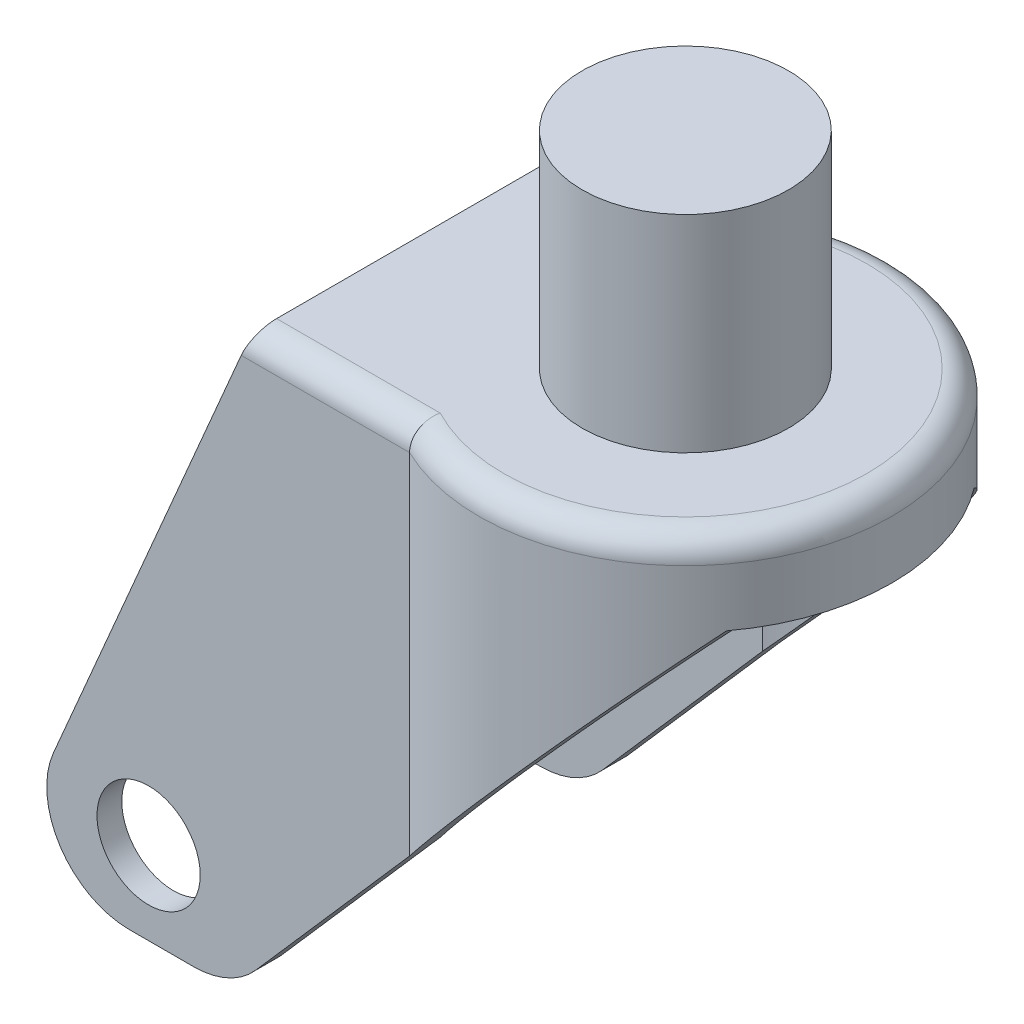
ISO-10303-21;
HEADER;
FILE_DESCRIPTION(('STEP AP214'),'2;1');
FILE_NAME('part.step','',(''),(''),'','','');
FILE_SCHEMA(('AUTOMOTIVE_DESIGN { 1 0 10303 214 1 1 1 1 }'));
ENDSEC;
DATA;
#1=APPLICATION_CONTEXT('core data for automotive mechanical design processes');
#2=APPLICATION_PROTOCOL_DEFINITION('international standard','automotive_design',2000,#1);
#3=PRODUCT_CONTEXT('',#1,'mechanical');
#4=PRODUCT('Part','Part','',(#3));
#5=PRODUCT_RELATED_PRODUCT_CATEGORY('part','',(#4));
#6=PRODUCT_DEFINITION_FORMATION('','',#4);
#7=PRODUCT_DEFINITION_CONTEXT('part definition',#1,'design');
#8=PRODUCT_DEFINITION('design','',#6,#7);
#9=PRODUCT_DEFINITION_SHAPE('','',#8);
#10=(LENGTH_UNIT() NAMED_UNIT(*) SI_UNIT(.MILLI.,.METRE.));
#11=(NAMED_UNIT(*) PLANE_ANGLE_UNIT() SI_UNIT($,.RADIAN.));
#12=(NAMED_UNIT(*) SI_UNIT($,.STERADIAN.) SOLID_ANGLE_UNIT());
#13=UNCERTAINTY_MEASURE_WITH_UNIT(LENGTH_MEASURE(1.E-05),#10,'distance_accuracy_value','');
#14=(GEOMETRIC_REPRESENTATION_CONTEXT(3) GLOBAL_UNCERTAINTY_ASSIGNED_CONTEXT((#13)) GLOBAL_UNIT_ASSIGNED_CONTEXT((#10,
#11,#12)) REPRESENTATION_CONTEXT('',''));
#15=CARTESIAN_POINT('',(0.,0.,0.));
#16=DIRECTION('',(0.,0.,1.));
#17=DIRECTION('',(1.,0.,0.));
#18=AXIS2_PLACEMENT_3D('',#15,#16,#17);
#19=CARTESIAN_POINT('',(0.,-60.,0.));
#20=DIRECTION('',(0.,1.,0.));
#21=DIRECTION('',(0.,0.,1.));
#22=AXIS2_PLACEMENT_3D('',#19,#20,#21);
#23=CYLINDRICAL_SURFACE('',#22,22.);
#24=CARTESIAN_POINT('',(0.,-3.,0.));
#25=DIRECTION('',(0.,1.,0.));
#26=DIRECTION('',(0.,0.,1.));
#27=AXIS2_PLACEMENT_3D('',#24,#25,#26);
#28=CIRCLE('',#27,22.);
#29=CARTESIAN_POINT('',(-10.1857743937317,-3.,-19.5));
#30=VERTEX_POINT('',#29);
#31=CARTESIAN_POINT('',(-10.1857743937317,-3.,19.5));
#32=VERTEX_POINT('',#31);
#33=EDGE_CURVE('E205',#30,#32,#28,.F.);
#34=ORIENTED_EDGE('',*,*,#33,.F.);
#35=DIRECTION('',(0.,1.,0.));
#36=VECTOR('',#35,1.);
#37=CARTESIAN_POINT('',(-10.1857743937317,-60.,-19.5));
#38=LINE('',#37,#36);
#39=CARTESIAN_POINT('',(-10.1857743937317,-44.4980278785505,-19.5));
#40=VERTEX_POINT('',#39);
#41=EDGE_CURVE('E210',#30,#40,#38,.F.);
#42=ORIENTED_EDGE('',*,*,#41,.T.);
#43=CARTESIAN_POINT('',(0.,-32.8571428571429,0.));
#44=DIRECTION('',(-0.752576694706878,0.658504607868518,0.));
#45=DIRECTION('',(0.658504607868518,0.752576694706878,0.));
#46=AXIS2_PLACEMENT_3D('',#43,#44,#45);
#47=ELLIPSE('',#46,33.409029697166,22.);
#48=CARTESIAN_POINT('',(20.,-10.,-9.16515138991168));
#49=VERTEX_POINT('',#48);
#50=EDGE_CURVE('E258',#40,#49,#47,.F.);
#51=ORIENTED_EDGE('',*,*,#50,.T.);
#52=CARTESIAN_POINT('',(0.,-10.,0.));
#53=DIRECTION('',(0.,1.,0.));
#54=DIRECTION('',(0.,0.,1.));
#55=AXIS2_PLACEMENT_3D('',#52,#53,#54);
#56=CIRCLE('',#55,22.);
#57=CARTESIAN_POINT('',(20.,-10.,9.16515138991167));
#58=VERTEX_POINT('',#57);
#59=EDGE_CURVE('E273',#49,#58,#56,.F.);
#60=ORIENTED_EDGE('',*,*,#59,.T.);
#61=CARTESIAN_POINT('',(-10.1857743937317,-44.4980278785505,19.5));
#62=VERTEX_POINT('',#61);
#63=EDGE_CURVE('E208',#58,#62,#47,.F.);
#64=ORIENTED_EDGE('',*,*,#63,.T.);
#65=DIRECTION('',(0.,1.,0.));
#66=VECTOR('',#65,1.);
#67=CARTESIAN_POINT('',(-10.1857743937317,-60.,19.5));
#68=LINE('',#67,#66);
#69=EDGE_CURVE('E192',#62,#32,#68,.T.);
#70=ORIENTED_EDGE('',*,*,#69,.T.);
#71=EDGE_LOOP('',(#34,#42,#51,#60,#64,#70));
#72=FACE_BOUND('',#71,.T.);
#73=ADVANCED_FACE('F62',(#72),#23,.F.);
#74=CARTESIAN_POINT('',(-60.,-70.,-22.5));
#75=DIRECTION('',(0.,-1.,0.));
#76=DIRECTION('',(0.,0.,-1.));
#77=AXIS2_PLACEMENT_3D('',#74,#75,#76);
#78=PLANE('',#77);
#79=DIRECTION('',(1.,0.,0.));
#80=VECTOR('',#79,1.);
#81=CARTESIAN_POINT('',(-64.875,-70.,19.5));
#82=LINE('',#81,#80);
#83=CARTESIAN_POINT('',(-44.8346098487659,-70.,19.5));
#84=VERTEX_POINT('',#83);
#85=CARTESIAN_POINT('',(-37.0376822659183,-70.,19.5));
#86=VERTEX_POINT('',#85);
#87=EDGE_CURVE('E218',#84,#86,#82,.T.);
#88=ORIENTED_EDGE('',*,*,#87,.T.);
#89=DIRECTION('',(0.,0.,-1.));
#90=VECTOR('',#89,1.);
#91=CARTESIAN_POINT('',(-37.0376822659183,-70.,22.5));
#92=LINE('',#91,#90);
#93=CARTESIAN_POINT('',(-37.0376822659183,-70.,22.5));
#94=VERTEX_POINT('',#93);
#95=EDGE_CURVE('E84',#86,#94,#92,.F.);
#96=ORIENTED_EDGE('',*,*,#95,.T.);
#97=DIRECTION('',(1.,0.,0.));
#98=VECTOR('',#97,1.);
#99=CARTESIAN_POINT('',(-60.,-70.,22.5));
#100=LINE('',#99,#98);
#101=CARTESIAN_POINT('',(-44.8346098487659,-70.,22.5));
#102=VERTEX_POINT('',#101);
#103=EDGE_CURVE('E199',#102,#94,#100,.T.);
#104=ORIENTED_EDGE('',*,*,#103,.F.);
#105=DIRECTION('',(0.,0.,-1.));
#106=VECTOR('',#105,1.);
#107=CARTESIAN_POINT('',(-44.8346098487659,-70.,19.5));
#108=LINE('',#107,#106);
#109=EDGE_CURVE('E420',#102,#84,#108,.T.);
#110=ORIENTED_EDGE('',*,*,#109,.T.);
#111=EDGE_LOOP('',(#88,#96,#104,#110));
#112=FACE_BOUND('',#111,.T.);
#113=ADVANCED_FACE('F338',(#112),#78,.T.);
#114=CARTESIAN_POINT('',(20.,-10.,-25.));
#115=DIRECTION('',(-0.752576694706878,0.658504607868518,0.));
#116=DIRECTION('',(-0.658504607868518,-0.752576694706878,0.));
#117=AXIS2_PLACEMENT_3D('',#114,#115,#116);
#118=PLANE('',#117);
#119=DIRECTION('',(-0.658504607868518,-0.752576694706878,0.));
#120=VECTOR('',#119,1.);
#121=CARTESIAN_POINT('',(-9.73451327433627,-43.9823008849558,22.5));
#122=LINE('',#121,#120);
#123=CARTESIAN_POINT('',(-10.8972473588517,-45.3111398386877,22.5));
#124=VERTEX_POINT('',#123);
#125=CARTESIAN_POINT('',(-29.5119153188495,-66.5850460786852,22.5));
#126=VERTEX_POINT('',#125);
#127=EDGE_CURVE('E252',#124,#126,#122,.T.);
#128=ORIENTED_EDGE('',*,*,#127,.T.);
#129=DIRECTION('',(0.,0.,-1.));
#130=VECTOR('',#129,1.);
#131=CARTESIAN_POINT('',(-29.5119153188495,-66.5850460786852,19.5));
#132=LINE('',#131,#130);
#133=CARTESIAN_POINT('',(-29.5119153188495,-66.5850460786852,19.5));
#134=VERTEX_POINT('',#133);
#135=EDGE_CURVE('E414',#126,#134,#132,.T.);
#136=ORIENTED_EDGE('',*,*,#135,.T.);
#137=DIRECTION('',(-0.658504607868518,-0.752576694706878,0.));
#138=VECTOR('',#137,1.);
#139=CARTESIAN_POINT('',(-9.73451327433627,-43.9823008849557,19.5));
#140=LINE('',#139,#138);
#141=EDGE_CURVE('E248',#62,#134,#140,.T.);
#142=ORIENTED_EDGE('',*,*,#141,.F.);
#143=ORIENTED_EDGE('',*,*,#63,.F.);
#144=DIRECTION('',(0.,0.,1.));
#145=VECTOR('',#144,1.);
#146=CARTESIAN_POINT('',(20.,-10.,-25.));
#147=LINE('',#146,#145);
#148=CARTESIAN_POINT('',(20.,-10.,15.));
#149=VERTEX_POINT('',#148);
#150=EDGE_CURVE('E209',#58,#149,#147,.T.);
#151=ORIENTED_EDGE('',*,*,#150,.T.);
#152=CARTESIAN_POINT('',(0.,-32.8571428571429,0.));
#153=DIRECTION('',(-0.752576694706878,0.658504607868518,0.));
#154=DIRECTION('',(0.658504607868518,0.752576694706878,0.));
#155=AXIS2_PLACEMENT_3D('',#152,#153,#154);
#156=ELLIPSE('',#155,37.9648064740523,25.);
#157=EDGE_CURVE('E255',#149,#124,#156,.F.);
#158=ORIENTED_EDGE('',*,*,#157,.T.);
#159=EDGE_LOOP('',(#128,#136,#142,#143,#151,#158));
#160=FACE_BOUND('',#159,.T.);
#161=ADVANCED_FACE('F343',(#160),#118,.F.);
#162=CARTESIAN_POINT('',(0.,-60.,0.));
#163=DIRECTION('',(0.,1.,0.));
#164=DIRECTION('',(0.,0.,1.));
#165=AXIS2_PLACEMENT_3D('',#162,#163,#164);
#166=CYLINDRICAL_SURFACE('',#165,25.);
#167=DIRECTION('',(0.,1.,0.));
#168=VECTOR('',#167,1.);
#169=CARTESIAN_POINT('',(-10.8972473588517,-60.,-22.5));
#170=LINE('',#169,#168);
#171=CARTESIAN_POINT('',(-10.8972473588517,-3.,-22.5));
#172=VERTEX_POINT('',#171);
#173=CARTESIAN_POINT('',(-10.8972473588517,-45.3111398386877,-22.5));
#174=VERTEX_POINT('',#173);
#175=EDGE_CURVE('E266',#172,#174,#170,.F.);
#176=ORIENTED_EDGE('',*,*,#175,.F.);
#177=CARTESIAN_POINT('',(0.,-3.,0.));
#178=DIRECTION('',(0.,1.,0.));
#179=DIRECTION('',(0.,0.,1.));
#180=AXIS2_PLACEMENT_3D('',#177,#178,#179);
#181=CIRCLE('',#180,25.);
#182=CARTESIAN_POINT('',(-10.8972473588517,-3.,22.5));
#183=VERTEX_POINT('',#182);
#184=EDGE_CURVE('E288',#172,#183,#181,.F.);
#185=ORIENTED_EDGE('',*,*,#184,.T.);
#186=DIRECTION('',(0.,1.,0.));
#187=VECTOR('',#186,1.);
#188=CARTESIAN_POINT('',(-10.8972473588517,-60.,22.5));
#189=LINE('',#188,#187);
#190=EDGE_CURVE('E270',#124,#183,#189,.T.);
#191=ORIENTED_EDGE('',*,*,#190,.F.);
#192=ORIENTED_EDGE('',*,*,#157,.F.);
#193=CARTESIAN_POINT('',(0.,-10.,0.));
#194=DIRECTION('',(0.,1.,0.));
#195=DIRECTION('',(0.,0.,1.));
#196=AXIS2_PLACEMENT_3D('',#193,#194,#195);
#197=CIRCLE('',#196,25.);
#198=CARTESIAN_POINT('',(20.,-10.,-15.));
#199=VERTEX_POINT('',#198);
#200=EDGE_CURVE('E260',#199,#149,#197,.F.);
#201=ORIENTED_EDGE('',*,*,#200,.F.);
#202=EDGE_CURVE('E256',#174,#199,#156,.F.);
#203=ORIENTED_EDGE('',*,*,#202,.F.);
#204=EDGE_LOOP('',(#176,#185,#191,#192,#201,#203));
#205=FACE_BOUND('',#204,.T.);
#206=ADVANCED_FACE('F351',(#205),#166,.T.);
#207=CARTESIAN_POINT('',(0.,0.,0.));
#208=DIRECTION('',(0.,1.,0.));
#209=DIRECTION('',(0.,0.,1.));
#210=AXIS2_PLACEMENT_3D('',#207,#208,#209);
#211=PLANE('',#210);
#212=CARTESIAN_POINT('',(0.,0.,0.));
#213=DIRECTION('',(0.,1.,0.));
#214=DIRECTION('',(0.,0.,1.));
#215=AXIS2_PLACEMENT_3D('',#212,#213,#214);
#216=CIRCLE('',#215,12.5);
#217=CARTESIAN_POINT('',(0.,0.,12.5));
#218=VERTEX_POINT('',#217);
#219=EDGE_CURVE('E476',#218,#218,#216,.T.);
#220=ORIENTED_EDGE('',*,*,#219,.F.);
#221=EDGE_LOOP('',(#220));
#222=FACE_BOUND('',#221,.T.);
#223=CARTESIAN_POINT('',(0.,0.,0.));
#224=DIRECTION('',(0.,1.,0.));
#225=DIRECTION('',(0.,0.,1.));
#226=AXIS2_PLACEMENT_3D('',#223,#224,#225);
#227=CIRCLE('',#226,22.);
#228=CARTESIAN_POINT('',(-10.1857743937317,0.,19.5));
#229=VERTEX_POINT('',#228);
#230=CARTESIAN_POINT('',(-10.1857743937317,0.,-19.5));
#231=VERTEX_POINT('',#230);
#232=EDGE_CURVE('E280',#229,#231,#227,.T.);
#233=ORIENTED_EDGE('',*,*,#232,.T.);
#234=DIRECTION('',(1.,0.,0.));
#235=VECTOR('',#234,1.);
#236=CARTESIAN_POINT('',(0.,0.,-19.5));
#237=LINE('',#236,#235);
#238=CARTESIAN_POINT('',(-30.,0.,-19.5));
#239=VERTEX_POINT('',#238);
#240=EDGE_CURVE('E282',#231,#239,#237,.F.);
#241=ORIENTED_EDGE('',*,*,#240,.T.);
#242=DIRECTION('',(0.,0.,1.));
#243=VECTOR('',#242,1.);
#244=CARTESIAN_POINT('',(-30.,0.,-25.));
#245=LINE('',#244,#243);
#246=CARTESIAN_POINT('',(-30.,0.,19.5));
#247=VERTEX_POINT('',#246);
#248=EDGE_CURVE('E228',#239,#247,#245,.T.);
#249=ORIENTED_EDGE('',*,*,#248,.T.);
#250=DIRECTION('',(1.,0.,0.));
#251=VECTOR('',#250,1.);
#252=CARTESIAN_POINT('',(0.,0.,19.5));
#253=LINE('',#252,#251);
#254=EDGE_CURVE('E278',#247,#229,#253,.T.);
#255=ORIENTED_EDGE('',*,*,#254,.T.);
#256=EDGE_LOOP('',(#233,#241,#249,#255));
#257=FACE_BOUND('',#256,.T.);
#258=ADVANCED_FACE('F349',(#222,#257),#211,.T.);
#259=CARTESIAN_POINT('',(-60.,0.,22.5));
#260=DIRECTION('',(0.,0.,1.));
#261=DIRECTION('',(0.,-1.,0.));
#262=AXIS2_PLACEMENT_3D('',#259,#260,#261);
#263=PLANE('',#262);
#264=CARTESIAN_POINT('',(-42.5,-60.,22.5));
#265=DIRECTION('',(0.,0.,1.));
#266=DIRECTION('',(1.,0.,0.));
#267=AXIS2_PLACEMENT_3D('',#264,#265,#266);
#268=CIRCLE('',#267,6.25000000000001);
#269=CARTESIAN_POINT('',(-36.25,-60.,22.5));
#270=VERTEX_POINT('',#269);
#271=EDGE_CURVE('E475',#270,#270,#268,.T.);
#272=ORIENTED_EDGE('',*,*,#271,.F.);
#273=EDGE_LOOP('',(#272));
#274=FACE_BOUND('',#273,.T.);
#275=ORIENTED_EDGE('',*,*,#103,.T.);
#276=CARTESIAN_POINT('',(-37.0376822659183,-60.,22.5));
#277=DIRECTION('',(0.,0.,1.));
#278=DIRECTION('',(0.,-1.,0.));
#279=AXIS2_PLACEMENT_3D('',#276,#277,#278);
#280=CIRCLE('',#279,10.);
#281=EDGE_CURVE('E426',#94,#126,#280,.T.);
#282=ORIENTED_EDGE('',*,*,#281,.T.);
#283=ORIENTED_EDGE('',*,*,#127,.F.);
#284=ORIENTED_EDGE('',*,*,#190,.T.);
#285=DIRECTION('',(1.,0.,0.));
#286=VECTOR('',#285,1.);
#287=CARTESIAN_POINT('',(-60.,-3.,22.5));
#288=LINE('',#287,#286);
#289=CARTESIAN_POINT('',(-31.2857142857143,-3.,22.5));
#290=VERTEX_POINT('',#289);
#291=EDGE_CURVE('E290',#183,#290,#288,.F.);
#292=ORIENTED_EDGE('',*,*,#291,.T.);
#293=DIRECTION('',(0.393919298579168,0.919145030018058,0.));
#294=VECTOR('',#293,1.);
#295=CARTESIAN_POINT('',(-34.6551724137931,-10.8620689655173,22.5));
#296=LINE('',#295,#294);
#297=CARTESIAN_POINT('',(-54.0260601489464,-56.0608070142083,22.5));
#298=VERTEX_POINT('',#297);
#299=EDGE_CURVE('E240',#298,#290,#296,.T.);
#300=ORIENTED_EDGE('',*,*,#299,.F.);
#301=CARTESIAN_POINT('',(-44.8346098487659,-60.,22.5));
#302=DIRECTION('',(0.,0.,1.));
#303=DIRECTION('',(0.,-1.,0.));
#304=AXIS2_PLACEMENT_3D('',#301,#302,#303);
#305=CIRCLE('',#304,10.);
#306=EDGE_CURVE('E424',#298,#102,#305,.T.);
#307=ORIENTED_EDGE('',*,*,#306,.T.);
#308=EDGE_LOOP('',(#275,#282,#283,#284,#292,#300,#307));
#309=FACE_BOUND('',#308,.T.);
#310=ADVANCED_FACE('F348',(#274,#309),#263,.T.);
#311=CARTESIAN_POINT('',(-60.,0.,-22.5));
#312=DIRECTION('',(0.,0.,-1.));
#313=DIRECTION('',(0.,1.,0.));
#314=AXIS2_PLACEMENT_3D('',#311,#312,#313);
#315=PLANE('',#314);
#316=CARTESIAN_POINT('',(-42.5,-60.,-22.5));
#317=DIRECTION('',(0.,0.,-1.));
#318=DIRECTION('',(0.,1.,0.));
#319=AXIS2_PLACEMENT_3D('',#316,#317,#318);
#320=CIRCLE('',#319,6.25000000000001);
#321=CARTESIAN_POINT('',(-42.5,-53.75,-22.5));
#322=VERTEX_POINT('',#321);
#323=EDGE_CURVE('E224',#322,#322,#320,.T.);
#324=ORIENTED_EDGE('',*,*,#323,.F.);
#325=EDGE_LOOP('',(#324));
#326=FACE_BOUND('',#325,.T.);
#327=DIRECTION('',(0.658504607868518,0.752576694706878,0.));
#328=VECTOR('',#327,1.);
#329=CARTESIAN_POINT('',(-9.73451327433627,-43.9823008849557,-22.5));
#330=LINE('',#329,#328);
#331=CARTESIAN_POINT('',(-29.5119153188495,-66.5850460786852,-22.5));
#332=VERTEX_POINT('',#331);
#333=EDGE_CURVE('E250',#332,#174,#330,.T.);
#334=ORIENTED_EDGE('',*,*,#333,.F.);
#335=CARTESIAN_POINT('',(-37.0376822659183,-60.,-22.5));
#336=DIRECTION('',(0.,0.,-1.));
#337=DIRECTION('',(0.,1.,0.));
#338=AXIS2_PLACEMENT_3D('',#335,#336,#337);
#339=CIRCLE('',#338,10.);
#340=CARTESIAN_POINT('',(-37.0376822659183,-70.,-22.5));
#341=VERTEX_POINT('',#340);
#342=EDGE_CURVE('E400',#332,#341,#339,.T.);
#343=ORIENTED_EDGE('',*,*,#342,.T.);
#344=DIRECTION('',(1.,0.,0.));
#345=VECTOR('',#344,1.);
#346=CARTESIAN_POINT('',(-60.,-70.,-22.5));
#347=LINE('',#346,#345);
#348=CARTESIAN_POINT('',(-44.8346098487658,-70.,-22.5));
#349=VERTEX_POINT('',#348);
#350=EDGE_CURVE('E263',#349,#341,#347,.T.);
#351=ORIENTED_EDGE('',*,*,#350,.F.);
#352=CARTESIAN_POINT('',(-44.8346098487658,-60.,-22.5));
#353=DIRECTION('',(0.,0.,-1.));
#354=DIRECTION('',(0.,1.,0.));
#355=AXIS2_PLACEMENT_3D('',#352,#353,#354);
#356=CIRCLE('',#355,10.);
#357=CARTESIAN_POINT('',(-54.0260601489464,-56.0608070142083,-22.5));
#358=VERTEX_POINT('',#357);
#359=EDGE_CURVE('E398',#349,#358,#356,.T.);
#360=ORIENTED_EDGE('',*,*,#359,.T.);
#361=DIRECTION('',(-0.393919298579168,-0.919145030018058,0.));
#362=VECTOR('',#361,1.);
#363=CARTESIAN_POINT('',(-34.6551724137931,-10.8620689655172,-22.5));
#364=LINE('',#363,#362);
#365=CARTESIAN_POINT('',(-31.2857142857143,-3.,-22.5));
#366=VERTEX_POINT('',#365);
#367=EDGE_CURVE('E237',#366,#358,#364,.T.);
#368=ORIENTED_EDGE('',*,*,#367,.F.);
#369=DIRECTION('',(1.,0.,0.));
#370=VECTOR('',#369,1.);
#371=CARTESIAN_POINT('',(-60.,-3.,-22.5));
#372=LINE('',#371,#370);
#373=EDGE_CURVE('E275',#366,#172,#372,.T.);
#374=ORIENTED_EDGE('',*,*,#373,.T.);
#375=ORIENTED_EDGE('',*,*,#175,.T.);
#376=EDGE_LOOP('',(#334,#343,#351,#360,#368,#374,#375));
#377=FACE_BOUND('',#376,.T.);
#378=ADVANCED_FACE('F368',(#326,#377),#315,.T.);
#379=ORIENTED_EDGE('',*,*,#350,.T.);
#380=DIRECTION('',(0.,0.,-1.));
#381=VECTOR('',#380,1.);
#382=CARTESIAN_POINT('',(-37.0376822659183,-70.,-19.5));
#383=LINE('',#382,#381);
#384=CARTESIAN_POINT('',(-37.0376822659183,-70.,-19.5));
#385=VERTEX_POINT('',#384);
#386=EDGE_CURVE('E408',#341,#385,#383,.F.);
#387=ORIENTED_EDGE('',*,*,#386,.T.);
#388=DIRECTION('',(-1.,0.,0.));
#389=VECTOR('',#388,1.);
#390=CARTESIAN_POINT('',(-29.875,-70.,-19.5));
#391=LINE('',#390,#389);
#392=CARTESIAN_POINT('',(-44.8346098487658,-70.,-19.5));
#393=VERTEX_POINT('',#392);
#394=EDGE_CURVE('E214',#385,#393,#391,.T.);
#395=ORIENTED_EDGE('',*,*,#394,.T.);
#396=DIRECTION('',(0.,0.,-1.));
#397=VECTOR('',#396,1.);
#398=CARTESIAN_POINT('',(-44.8346098487658,-70.,-22.5));
#399=LINE('',#398,#397);
#400=EDGE_CURVE('E405',#393,#349,#399,.T.);
#401=ORIENTED_EDGE('',*,*,#400,.T.);
#402=EDGE_LOOP('',(#379,#387,#395,#401));
#403=FACE_BOUND('',#402,.T.);
#404=ADVANCED_FACE('F345',(#403),#78,.T.);
#405=CARTESIAN_POINT('',(-60.,0.,19.5));
#406=DIRECTION('',(0.,0.,1.));
#407=DIRECTION('',(0.,-1.,0.));
#408=AXIS2_PLACEMENT_3D('',#405,#406,#407);
#409=PLANE('',#408);
#410=CARTESIAN_POINT('',(-42.5,-60.,19.5));
#411=DIRECTION('',(0.,0.,1.));
#412=DIRECTION('',(0.,-1.,0.));
#413=AXIS2_PLACEMENT_3D('',#410,#411,#412);
#414=CIRCLE('',#413,6.25000000000001);
#415=CARTESIAN_POINT('',(-42.5,-66.25,19.5));
#416=VERTEX_POINT('',#415);
#417=EDGE_CURVE('E482',#416,#416,#414,.T.);
#418=ORIENTED_EDGE('',*,*,#417,.T.);
#419=EDGE_LOOP('',(#418));
#420=FACE_BOUND('',#419,.T.);
#421=ORIENTED_EDGE('',*,*,#141,.T.);
#422=CARTESIAN_POINT('',(-37.0376822659183,-60.,19.5));
#423=DIRECTION('',(0.,0.,1.));
#424=DIRECTION('',(0.,-1.,0.));
#425=AXIS2_PLACEMENT_3D('',#422,#423,#424);
#426=CIRCLE('',#425,10.);
#427=EDGE_CURVE('E418',#134,#86,#426,.F.);
#428=ORIENTED_EDGE('',*,*,#427,.T.);
#429=ORIENTED_EDGE('',*,*,#87,.F.);
#430=CARTESIAN_POINT('',(-44.8346098487659,-60.,19.5));
#431=DIRECTION('',(0.,0.,1.));
#432=DIRECTION('',(0.,-1.,0.));
#433=AXIS2_PLACEMENT_3D('',#430,#431,#432);
#434=CIRCLE('',#433,10.);
#435=CARTESIAN_POINT('',(-54.0260601489464,-56.0608070142083,19.5));
#436=VERTEX_POINT('',#435);
#437=EDGE_CURVE('E416',#84,#436,#434,.F.);
#438=ORIENTED_EDGE('',*,*,#437,.T.);
#439=DIRECTION('',(0.393919298579168,0.919145030018058,0.));
#440=VECTOR('',#439,1.);
#441=CARTESIAN_POINT('',(-34.6551724137931,-10.8620689655172,19.5));
#442=LINE('',#441,#440);
#443=CARTESIAN_POINT('',(-31.2857142857143,-3.00000000000001,19.5));
#444=VERTEX_POINT('',#443);
#445=EDGE_CURVE('E194',#436,#444,#442,.T.);
#446=ORIENTED_EDGE('',*,*,#445,.T.);
#447=DIRECTION('',(1.,0.,0.));
#448=VECTOR('',#447,1.);
#449=CARTESIAN_POINT('',(-60.,-3.00000000000001,19.5));
#450=LINE('',#449,#448);
#451=EDGE_CURVE('E188',#444,#32,#450,.T.);
#452=ORIENTED_EDGE('',*,*,#451,.T.);
#453=ORIENTED_EDGE('',*,*,#69,.F.);
#454=EDGE_LOOP('',(#421,#428,#429,#438,#446,#452,#453));
#455=FACE_BOUND('',#454,.T.);
#456=ADVANCED_FACE('F191',(#420,#455),#409,.F.);
#457=CARTESIAN_POINT('',(-60.,-3.00000000000001,0.));
#458=DIRECTION('',(0.,1.,0.));
#459=DIRECTION('',(0.,0.,1.));
#460=AXIS2_PLACEMENT_3D('',#457,#458,#459);
#461=PLANE('',#460);
#462=DIRECTION('',(1.,0.,0.));
#463=VECTOR('',#462,1.);
#464=CARTESIAN_POINT('',(-60.,-3.,-19.5));
#465=LINE('',#464,#463);
#466=CARTESIAN_POINT('',(-31.2857142857143,-3.,-19.5));
#467=VERTEX_POINT('',#466);
#468=EDGE_CURVE('E200',#467,#30,#465,.T.);
#469=ORIENTED_EDGE('',*,*,#468,.T.);
#470=ORIENTED_EDGE('',*,*,#33,.T.);
#471=ORIENTED_EDGE('',*,*,#451,.F.);
#472=DIRECTION('',(0.,0.,-1.));
#473=VECTOR('',#472,1.);
#474=CARTESIAN_POINT('',(-31.2857142857143,-3.00000000000001,0.));
#475=LINE('',#474,#473);
#476=EDGE_CURVE('E234',#444,#467,#475,.T.);
#477=ORIENTED_EDGE('',*,*,#476,.T.);
#478=EDGE_LOOP('',(#469,#470,#471,#477));
#479=FACE_BOUND('',#478,.T.);
#480=ADVANCED_FACE('F212',(#479),#461,.F.);
#481=CARTESIAN_POINT('',(-60.,0.,-19.5));
#482=DIRECTION('',(0.,0.,-1.));
#483=DIRECTION('',(0.,1.,0.));
#484=AXIS2_PLACEMENT_3D('',#481,#482,#483);
#485=PLANE('',#484);
#486=CARTESIAN_POINT('',(-42.5,-60.,-19.5));
#487=DIRECTION('',(0.,0.,-1.));
#488=DIRECTION('',(0.,1.,0.));
#489=AXIS2_PLACEMENT_3D('',#486,#487,#488);
#490=CIRCLE('',#489,6.25000000000001);
#491=CARTESIAN_POINT('',(-42.5,-53.75,-19.5));
#492=VERTEX_POINT('',#491);
#493=EDGE_CURVE('E402',#492,#492,#490,.T.);
#494=ORIENTED_EDGE('',*,*,#493,.T.);
#495=EDGE_LOOP('',(#494));
#496=FACE_BOUND('',#495,.T.);
#497=ORIENTED_EDGE('',*,*,#394,.F.);
#498=CARTESIAN_POINT('',(-37.0376822659183,-60.,-19.5));
#499=DIRECTION('',(0.,0.,-1.));
#500=DIRECTION('',(0.,1.,0.));
#501=AXIS2_PLACEMENT_3D('',#498,#499,#500);
#502=CIRCLE('',#501,10.);
#503=CARTESIAN_POINT('',(-29.5119153188495,-66.5850460786852,-19.5));
#504=VERTEX_POINT('',#503);
#505=EDGE_CURVE('E412',#385,#504,#502,.F.);
#506=ORIENTED_EDGE('',*,*,#505,.T.);
#507=DIRECTION('',(0.658504607868518,0.752576694706878,0.));
#508=VECTOR('',#507,1.);
#509=CARTESIAN_POINT('',(-9.73451327433627,-43.9823008849557,-19.5));
#510=LINE('',#509,#508);
#511=EDGE_CURVE('E246',#504,#40,#510,.T.);
#512=ORIENTED_EDGE('',*,*,#511,.T.);
#513=ORIENTED_EDGE('',*,*,#41,.F.);
#514=ORIENTED_EDGE('',*,*,#468,.F.);
#515=DIRECTION('',(-0.393919298579168,-0.919145030018058,0.));
#516=VECTOR('',#515,1.);
#517=CARTESIAN_POINT('',(-34.6551724137931,-10.8620689655172,-19.5));
#518=LINE('',#517,#516);
#519=CARTESIAN_POINT('',(-54.0260601489464,-56.0608070142083,-19.5));
#520=VERTEX_POINT('',#519);
#521=EDGE_CURVE('E231',#467,#520,#518,.T.);
#522=ORIENTED_EDGE('',*,*,#521,.T.);
#523=CARTESIAN_POINT('',(-44.8346098487658,-60.,-19.5));
#524=DIRECTION('',(0.,0.,-1.));
#525=DIRECTION('',(0.,1.,0.));
#526=AXIS2_PLACEMENT_3D('',#523,#524,#525);
#527=CIRCLE('',#526,10.);
#528=EDGE_CURVE('E410',#520,#393,#527,.F.);
#529=ORIENTED_EDGE('',*,*,#528,.T.);
#530=EDGE_LOOP('',(#497,#506,#512,#513,#514,#522,#529));
#531=FACE_BOUND('',#530,.T.);
#532=ADVANCED_FACE('F432',(#496,#531),#485,.F.);
#533=CARTESIAN_POINT('',(20.,-10.,-25.));
#534=DIRECTION('',(0.,1.,0.));
#535=DIRECTION('',(0.,0.,1.));
#536=AXIS2_PLACEMENT_3D('',#533,#534,#535);
#537=PLANE('',#536);
#538=ORIENTED_EDGE('',*,*,#200,.T.);
#539=ORIENTED_EDGE('',*,*,#150,.F.);
#540=ORIENTED_EDGE('',*,*,#59,.F.);
#541=EDGE_CURVE('E245',#199,#49,#147,.T.);
#542=ORIENTED_EDGE('',*,*,#541,.F.);
#543=EDGE_LOOP('',(#538,#539,#540,#542));
#544=FACE_BOUND('',#543,.T.);
#545=ADVANCED_FACE('F389',(#544),#537,.F.);
#546=ORIENTED_EDGE('',*,*,#511,.F.);
#547=DIRECTION('',(0.,0.,-1.));
#548=VECTOR('',#547,1.);
#549=CARTESIAN_POINT('',(-29.5119153188495,-66.5850460786852,-22.5));
#550=LINE('',#549,#548);
#551=EDGE_CURVE('E293',#504,#332,#550,.T.);
#552=ORIENTED_EDGE('',*,*,#551,.T.);
#553=ORIENTED_EDGE('',*,*,#333,.T.);
#554=ORIENTED_EDGE('',*,*,#202,.T.);
#555=ORIENTED_EDGE('',*,*,#541,.T.);
#556=ORIENTED_EDGE('',*,*,#50,.F.);
#557=EDGE_LOOP('',(#546,#552,#553,#554,#555,#556));
#558=FACE_BOUND('',#557,.T.);
#559=ADVANCED_FACE('F360',(#558),#118,.F.);
#560=CARTESIAN_POINT('',(-30.,0.,-25.));
#561=DIRECTION('',(0.919145030018058,-0.393919298579168,0.));
#562=DIRECTION('',(0.393919298579168,0.919145030018058,0.));
#563=AXIS2_PLACEMENT_3D('',#560,#561,#562);
#564=PLANE('',#563);
#565=ORIENTED_EDGE('',*,*,#367,.T.);
#566=DIRECTION('',(0.,0.,-1.));
#567=VECTOR('',#566,1.);
#568=CARTESIAN_POINT('',(-54.0260601489464,-56.0608070142083,-19.5));
#569=LINE('',#568,#567);
#570=EDGE_CURVE('E12',#358,#520,#569,.F.);
#571=ORIENTED_EDGE('',*,*,#570,.T.);
#572=ORIENTED_EDGE('',*,*,#521,.F.);
#573=ORIENTED_EDGE('',*,*,#476,.F.);
#574=ORIENTED_EDGE('',*,*,#445,.F.);
#575=DIRECTION('',(0.,0.,-1.));
#576=VECTOR('',#575,1.);
#577=CARTESIAN_POINT('',(-54.0260601489464,-56.0608070142083,22.5));
#578=LINE('',#577,#576);
#579=EDGE_CURVE('E70',#436,#298,#578,.F.);
#580=ORIENTED_EDGE('',*,*,#579,.T.);
#581=ORIENTED_EDGE('',*,*,#299,.T.);
#582=CARTESIAN_POINT('',(-31.2857142857143,-3.,19.5));
#583=DIRECTION('',(0.919145030018058,-0.393919298579168,0.));
#584=DIRECTION('',(0.393919298579168,0.919145030018058,0.));
#585=AXIS2_PLACEMENT_3D('',#582,#583,#584);
#586=ELLIPSE('',#585,3.26390275965596,3.);
#587=EDGE_CURVE('E284',#290,#247,#586,.F.);
#588=ORIENTED_EDGE('',*,*,#587,.T.);
#589=ORIENTED_EDGE('',*,*,#248,.F.);
#590=CARTESIAN_POINT('',(-31.2857142857143,-3.,-19.5));
#591=DIRECTION('',(0.919145030018058,-0.393919298579168,0.));
#592=DIRECTION('',(0.393919298579168,0.919145030018058,0.));
#593=AXIS2_PLACEMENT_3D('',#590,#591,#592);
#594=ELLIPSE('',#593,3.26390275965596,3.);
#595=EDGE_CURVE('E286',#239,#366,#594,.F.);
#596=ORIENTED_EDGE('',*,*,#595,.T.);
#597=EDGE_LOOP('',(#565,#571,#572,#573,#574,#580,#581,#588,#589,#596));
#598=FACE_BOUND('',#597,.T.);
#599=ADVANCED_FACE('F318',(#598),#564,.F.);
#600=CARTESIAN_POINT('',(0.,-3.,19.5));
#601=DIRECTION('',(1.,0.,0.));
#602=DIRECTION('',(0.,0.,-1.));
#603=AXIS2_PLACEMENT_3D('',#600,#601,#602);
#604=CYLINDRICAL_SURFACE('',#603,3.);
#605=ORIENTED_EDGE('',*,*,#587,.F.);
#606=ORIENTED_EDGE('',*,*,#291,.F.);
#607=CARTESIAN_POINT('',(-10.8972473588517,-3.,22.5));
#608=CARTESIAN_POINT('',(-10.8972491084667,-2.91719965956392,22.5000091795096));
#609=CARTESIAN_POINT('',(-10.8964609461817,-2.83440377286824,22.4965721471373));
#610=CARTESIAN_POINT('',(-10.8933184354378,-2.66941577396233,22.4828764027399));
#611=CARTESIAN_POINT('',(-10.8909642371958,-2.58722360460694,22.4726183449995));
#612=CARTESIAN_POINT('',(-10.8847075813053,-2.42413372971975,22.4453699695701));
#613=CARTESIAN_POINT('',(-10.8808072517946,-2.34323440324841,22.428388905653));
#614=CARTESIAN_POINT('',(-10.8714891029437,-2.18321339332814,22.3878507647635));
#615=CARTESIAN_POINT('',(-10.8660712882358,-2.10409170445367,22.3642937078647));
#616=CARTESIAN_POINT('',(-10.8475868690432,-1.87019006324306,22.2839973007993));
#617=CARTESIAN_POINT('',(-10.8322851588314,-1.71876638928976,22.2176146561619));
#618=CARTESIAN_POINT('',(-10.7961560445626,-1.42944122978364,22.0613322287131));
#619=CARTESIAN_POINT('',(-10.7753288280188,-1.29153928557571,21.9714332439523));
#620=CARTESIAN_POINT('',(-10.7284417927446,-1.03138550471986,21.769781843736));
#621=CARTESIAN_POINT('',(-10.7023293410064,-0.909313147170428,21.6578099332253));
#622=CARTESIAN_POINT('',(-10.6456809178345,-0.685629904663016,21.4159442680224));
#623=CARTESIAN_POINT('',(-10.6151435372522,-0.584025562613775,21.2860448048084));
#624=CARTESIAN_POINT('',(-10.5496321641289,-0.401546549395176,21.00872818699));
#625=CARTESIAN_POINT('',(-10.5145685797919,-0.321233991275777,20.8609627621914));
#626=CARTESIAN_POINT('',(-10.4415069240997,-0.18655835058751,20.5547472901099));
#627=CARTESIAN_POINT('',(-10.4035098021681,-0.132186912879261,20.3963007018162));
#628=CARTESIAN_POINT('',(-10.3361501108144,-0.0616250292768389,20.1170377580298));
#629=CARTESIAN_POINT('',(-10.3072394059738,-0.0390796947141384,19.9976652558694));
#630=CARTESIAN_POINT('',(-10.2487896116757,-0.00861609039473894,19.7573676404752));
#631=CARTESIAN_POINT('',(-10.2192517683194,-0.000671141722616675,19.6364457664928));
#632=CARTESIAN_POINT('',(-10.1883324587716,-1.35475852568432E-05,19.5104233250935));
#633=CARTESIAN_POINT('',(-10.1870535123217,3.49446628273642E-08,19.5052115189049));
#634=CARTESIAN_POINT('',(-10.1857743937317,0.,19.5));
#635=B_SPLINE_CURVE_WITH_KNOTS('',3,(#607,#608,#609,#610,#611,#612,#613,#614,#615,#616,#617,
#618,#619,#620,#621,#622,#623,#624,#625,#626,#627,#628,#629,#630,#631,#632,#633,#634),
.UNSPECIFIED.,.F.,.F.,(4,2,2,2,2,2,2,2,2,2,2,2,2,4),(0.,0.248318101862333,0.49661238805105,
0.744566095217574,0.992519045498721,1.48810284772461,1.98366983400045,2.48443891831422,
2.98536782785671,3.49843779741775,4.01134240519996,4.3851949176177,4.75836361694446,
4.77446289229603),.UNSPECIFIED.);
#636=EDGE_CURVE('E215',#229,#183,#635,.F.);
#637=ORIENTED_EDGE('',*,*,#636,.F.);
#638=ORIENTED_EDGE('',*,*,#254,.F.);
#639=EDGE_LOOP('',(#605,#606,#637,#638));
#640=FACE_BOUND('',#639,.T.);
#641=ADVANCED_FACE('F312',(#640),#604,.T.);
#642=CARTESIAN_POINT('',(0.,-3.,0.));
#643=DIRECTION('',(0.,1.,0.));
#644=DIRECTION('',(0.,0.,1.));
#645=AXIS2_PLACEMENT_3D('',#642,#643,#644);
#646=TOROIDAL_SURFACE('',#645,22.,3.);
#647=ORIENTED_EDGE('',*,*,#636,.T.);
#648=ORIENTED_EDGE('',*,*,#184,.F.);
#649=CARTESIAN_POINT('',(-10.8972473588517,-3.,-22.5));
#650=CARTESIAN_POINT('',(-10.8972491084667,-2.91719965956392,-22.5000091795096));
#651=CARTESIAN_POINT('',(-10.8964609461817,-2.83440377286824,-22.4965721471373));
#652=CARTESIAN_POINT('',(-10.8933184354378,-2.66941577396233,-22.4828764027399));
#653=CARTESIAN_POINT('',(-10.8909642371958,-2.58722360460694,-22.4726183449995));
#654=CARTESIAN_POINT('',(-10.8847075813053,-2.42413372971975,-22.4453699695701));
#655=CARTESIAN_POINT('',(-10.8808072517946,-2.34323440324841,-22.428388905653));
#656=CARTESIAN_POINT('',(-10.8714891029438,-2.18321339332814,-22.3878507647635));
#657=CARTESIAN_POINT('',(-10.8660712882359,-2.10409170445367,-22.3642937078647));
#658=CARTESIAN_POINT('',(-10.8475868690432,-1.87019006324306,-22.2839973007993));
#659=CARTESIAN_POINT('',(-10.8322851588314,-1.71876638928976,-22.2176146561618));
#660=CARTESIAN_POINT('',(-10.7961560445626,-1.42944122978364,-22.0613322287131));
#661=CARTESIAN_POINT('',(-10.7753288280188,-1.29153928557571,-21.9714332439523));
#662=CARTESIAN_POINT('',(-10.7284417927446,-1.03138550471986,-21.7697818437359));
#663=CARTESIAN_POINT('',(-10.7023293410064,-0.909313147170425,-21.6578099332253));
#664=CARTESIAN_POINT('',(-10.6456809178346,-0.685629904663013,-21.4159442680224));
#665=CARTESIAN_POINT('',(-10.6151435372523,-0.584025562613774,-21.2860448048084));
#666=CARTESIAN_POINT('',(-10.549632164129,-0.401546549395176,-21.0087281869899));
#667=CARTESIAN_POINT('',(-10.5145685797919,-0.321233991275778,-20.8609627621914));
#668=CARTESIAN_POINT('',(-10.4415069240998,-0.186558350587511,-20.5547472901099));
#669=CARTESIAN_POINT('',(-10.4035098021683,-0.132186912879261,-20.3963007018161));
#670=CARTESIAN_POINT('',(-10.3361501108144,-0.0616250292768391,-20.1170377580298));
#671=CARTESIAN_POINT('',(-10.3072394059736,-0.0390796947141392,-19.9976652558695));
#672=CARTESIAN_POINT('',(-10.248789611676,-0.00861609039473777,-19.7573676404751));
#673=CARTESIAN_POINT('',(-10.2192517683203,-0.000671141722613177,-19.6364457664926));
#674=CARTESIAN_POINT('',(-10.1883324587717,-1.35475852565465E-05,-19.5104233250935));
#675=CARTESIAN_POINT('',(-10.1870535123217,3.49446629815559E-08,-19.5052115189048));
#676=CARTESIAN_POINT('',(-10.1857743937317,0.,-19.5));
#677=B_SPLINE_CURVE_WITH_KNOTS('',3,(#649,#650,#651,#652,#653,#654,#655,#656,#657,#658,#659,
#660,#661,#662,#663,#664,#665,#666,#667,#668,#669,#670,#671,#672,#673,#674,#675,#676),
.UNSPECIFIED.,.F.,.F.,(4,2,2,2,2,2,2,2,2,2,2,2,2,4),(0.,0.248318101862332,0.496612388051049,
0.744566095217574,0.99251904549872,1.48810284772461,1.98366983400045,2.48443891831423,
2.98536782785671,3.49843779741775,4.01134240519996,4.38519491761769,4.75836361694446,
4.77446289229603),.UNSPECIFIED.);
#678=EDGE_CURVE('E221',#231,#172,#677,.F.);
#679=ORIENTED_EDGE('',*,*,#678,.F.);
#680=ORIENTED_EDGE('',*,*,#232,.F.);
#681=EDGE_LOOP('',(#647,#648,#679,#680));
#682=FACE_BOUND('',#681,.T.);
#683=ADVANCED_FACE('F309',(#682),#646,.T.);
#684=CARTESIAN_POINT('',(-60.,-3.,-19.5));
#685=DIRECTION('',(1.,0.,0.));
#686=DIRECTION('',(0.,0.,-1.));
#687=AXIS2_PLACEMENT_3D('',#684,#685,#686);
#688=CYLINDRICAL_SURFACE('',#687,3.);
#689=ORIENTED_EDGE('',*,*,#595,.F.);
#690=ORIENTED_EDGE('',*,*,#240,.F.);
#691=ORIENTED_EDGE('',*,*,#678,.T.);
#692=ORIENTED_EDGE('',*,*,#373,.F.);
#693=EDGE_LOOP('',(#689,#690,#691,#692));
#694=FACE_BOUND('',#693,.T.);
#695=ADVANCED_FACE('F306',(#694),#688,.T.);
#696=CARTESIAN_POINT('',(-42.5,-60.,-25.));
#697=DIRECTION('',(0.,0.,1.));
#698=DIRECTION('',(1.,0.,0.));
#699=AXIS2_PLACEMENT_3D('',#696,#697,#698);
#700=CYLINDRICAL_SURFACE('',#699,6.25000000000001);
#701=ORIENTED_EDGE('',*,*,#323,.T.);
#702=EDGE_LOOP('',(#701));
#703=FACE_BOUND('',#702,.T.);
#704=ORIENTED_EDGE('',*,*,#493,.F.);
#705=EDGE_LOOP('',(#704));
#706=FACE_BOUND('',#705,.T.);
#707=ADVANCED_FACE('F462',(#703,#706),#700,.F.);
#708=ORIENTED_EDGE('',*,*,#271,.T.);
#709=EDGE_LOOP('',(#708));
#710=FACE_BOUND('',#709,.T.);
#711=ORIENTED_EDGE('',*,*,#417,.F.);
#712=EDGE_LOOP('',(#711));
#713=FACE_BOUND('',#712,.T.);
#714=ADVANCED_FACE('F324',(#710,#713),#700,.F.);
#715=CARTESIAN_POINT('',(-37.0376822659183,-60.,-25.));
#716=DIRECTION('',(0.,0.,1.));
#717=DIRECTION('',(0.,-1.,0.));
#718=AXIS2_PLACEMENT_3D('',#715,#716,#717);
#719=CYLINDRICAL_SURFACE('',#718,10.);
#720=ORIENTED_EDGE('',*,*,#505,.F.);
#721=ORIENTED_EDGE('',*,*,#386,.F.);
#722=ORIENTED_EDGE('',*,*,#342,.F.);
#723=ORIENTED_EDGE('',*,*,#551,.F.);
#724=EDGE_LOOP('',(#720,#721,#722,#723));
#725=FACE_BOUND('',#724,.T.);
#726=ADVANCED_FACE('F320',(#725),#719,.T.);
#727=CARTESIAN_POINT('',(-37.0376822659183,-60.,-25.));
#728=DIRECTION('',(0.,0.,1.));
#729=DIRECTION('',(0.,-1.,0.));
#730=AXIS2_PLACEMENT_3D('',#727,#728,#729);
#731=CYLINDRICAL_SURFACE('',#730,10.);
#732=ORIENTED_EDGE('',*,*,#281,.F.);
#733=ORIENTED_EDGE('',*,*,#95,.F.);
#734=ORIENTED_EDGE('',*,*,#427,.F.);
#735=ORIENTED_EDGE('',*,*,#135,.F.);
#736=EDGE_LOOP('',(#732,#733,#734,#735));
#737=FACE_BOUND('',#736,.T.);
#738=ADVANCED_FACE('F323',(#737),#731,.T.);
#739=CARTESIAN_POINT('',(-44.8346098487658,-60.,-22.5));
#740=DIRECTION('',(0.,0.,1.));
#741=DIRECTION('',(0.,-1.,0.));
#742=AXIS2_PLACEMENT_3D('',#739,#740,#741);
#743=CYLINDRICAL_SURFACE('',#742,10.);
#744=ORIENTED_EDGE('',*,*,#528,.F.);
#745=ORIENTED_EDGE('',*,*,#570,.F.);
#746=ORIENTED_EDGE('',*,*,#359,.F.);
#747=ORIENTED_EDGE('',*,*,#400,.F.);
#748=EDGE_LOOP('',(#744,#745,#746,#747));
#749=FACE_BOUND('',#748,.T.);
#750=ADVANCED_FACE('F327',(#749),#743,.T.);
#751=CARTESIAN_POINT('',(-44.8346098487658,-60.,-22.5));
#752=DIRECTION('',(0.,0.,1.));
#753=DIRECTION('',(0.,-1.,0.));
#754=AXIS2_PLACEMENT_3D('',#751,#752,#753);
#755=CYLINDRICAL_SURFACE('',#754,10.);
#756=ORIENTED_EDGE('',*,*,#306,.F.);
#757=ORIENTED_EDGE('',*,*,#579,.F.);
#758=ORIENTED_EDGE('',*,*,#437,.F.);
#759=ORIENTED_EDGE('',*,*,#109,.F.);
#760=EDGE_LOOP('',(#756,#757,#758,#759));
#761=FACE_BOUND('',#760,.T.);
#762=ADVANCED_FACE('F64',(#761),#755,.T.);
#763=CARTESIAN_POINT('',(0.,25.,0.));
#764=DIRECTION('',(0.,-1.,0.));
#765=DIRECTION('',(0.,0.,-1.));
#766=AXIS2_PLACEMENT_3D('',#763,#764,#765);
#767=CYLINDRICAL_SURFACE('',#766,12.5);
#768=CARTESIAN_POINT('',(0.,25.,0.));
#769=DIRECTION('',(0.,1.,0.));
#770=DIRECTION('',(0.,0.,1.));
#771=AXIS2_PLACEMENT_3D('',#768,#769,#770);
#772=CIRCLE('',#771,12.5);
#773=CARTESIAN_POINT('',(0.,25.,12.5));
#774=VERTEX_POINT('',#773);
#775=EDGE_CURVE('E474',#774,#774,#772,.T.);
#776=ORIENTED_EDGE('',*,*,#775,.F.);
#777=EDGE_LOOP('',(#776));
#778=FACE_BOUND('',#777,.T.);
#779=ORIENTED_EDGE('',*,*,#219,.T.);
#780=EDGE_LOOP('',(#779));
#781=FACE_BOUND('',#780,.T.);
#782=ADVANCED_FACE('F334',(#778,#781),#767,.T.);
#783=CARTESIAN_POINT('',(0.,25.,0.));
#784=DIRECTION('',(0.,1.,0.));
#785=DIRECTION('',(0.,0.,1.));
#786=AXIS2_PLACEMENT_3D('',#783,#784,#785);
#787=PLANE('',#786);
#788=ORIENTED_EDGE('',*,*,#775,.T.);
#789=EDGE_LOOP('',(#788));
#790=FACE_BOUND('',#789,.T.);
#791=ADVANCED_FACE('F466',(#790),#787,.T.);
#792=CLOSED_SHELL('',(#73,#113,#161,#206,#258,#310,#378,#404,#456,#480,#532,#545,#559,#599,#641,
#683,#695,#707,#714,#726,#738,#750,#762,#782,#791));
#793=MANIFOLD_SOLID_BREP('B2',#792);
#794=ADVANCED_BREP_SHAPE_REPRESENTATION('',(#18,#793),#14);
#795=SHAPE_DEFINITION_REPRESENTATION(#9,#794);
ENDSEC;
END-ISO-10303-21;
